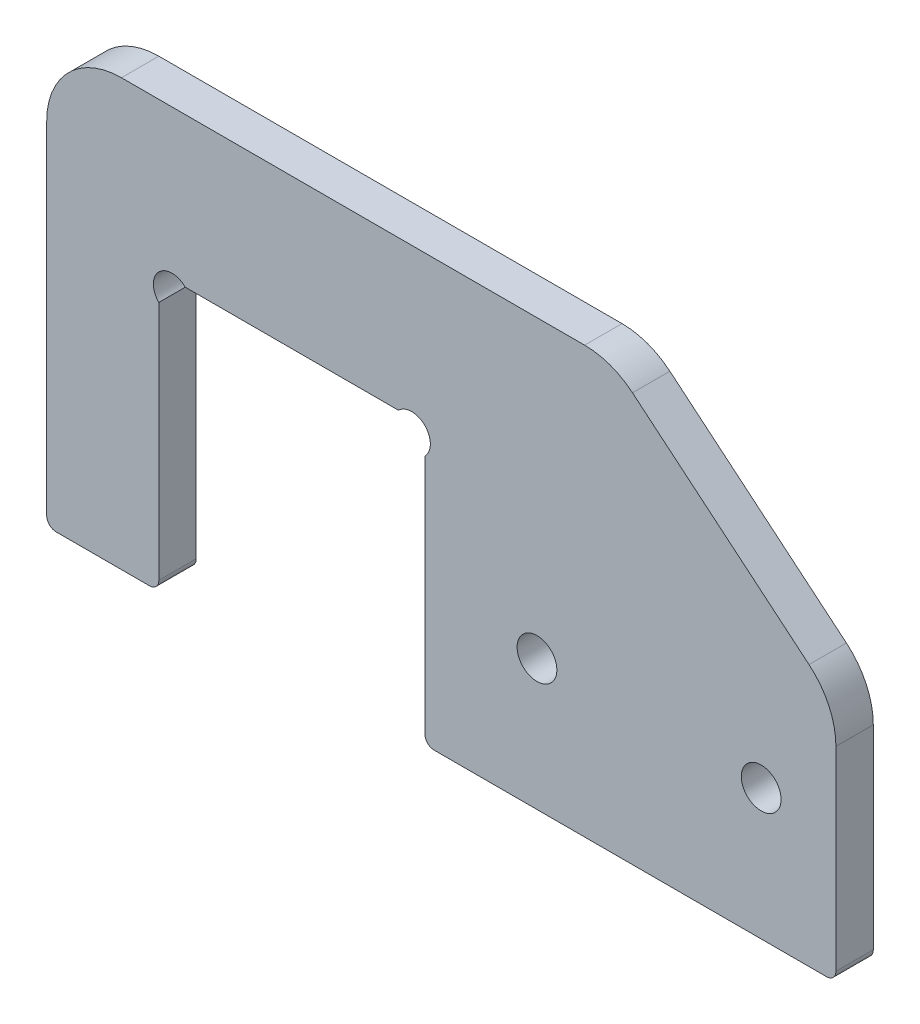
ISO-10303-21;
HEADER;
FILE_DESCRIPTION(('STEP AP214'),'2;1');
FILE_NAME('part.step','',(''),(''),'','','');
FILE_SCHEMA(('AUTOMOTIVE_DESIGN { 1 0 10303 214 1 1 1 1 }'));
ENDSEC;
DATA;
#1=APPLICATION_CONTEXT('core data for automotive mechanical design processes');
#2=APPLICATION_PROTOCOL_DEFINITION('international standard','automotive_design',2000,#1);
#3=PRODUCT_CONTEXT('',#1,'mechanical');
#4=PRODUCT('Part','Part','',(#3));
#5=PRODUCT_RELATED_PRODUCT_CATEGORY('part','',(#4));
#6=PRODUCT_DEFINITION_FORMATION('','',#4);
#7=PRODUCT_DEFINITION_CONTEXT('part definition',#1,'design');
#8=PRODUCT_DEFINITION('design','',#6,#7);
#9=PRODUCT_DEFINITION_SHAPE('','',#8);
#10=(LENGTH_UNIT() NAMED_UNIT(*) SI_UNIT(.MILLI.,.METRE.));
#11=(NAMED_UNIT(*) PLANE_ANGLE_UNIT() SI_UNIT($,.RADIAN.));
#12=(NAMED_UNIT(*) SI_UNIT($,.STERADIAN.) SOLID_ANGLE_UNIT());
#13=UNCERTAINTY_MEASURE_WITH_UNIT(LENGTH_MEASURE(1.E-05),#10,'distance_accuracy_value','');
#14=(GEOMETRIC_REPRESENTATION_CONTEXT(3) GLOBAL_UNCERTAINTY_ASSIGNED_CONTEXT((#13)) GLOBAL_UNIT_ASSIGNED_CONTEXT((#10,
#11,#12)) REPRESENTATION_CONTEXT('',''));
#15=CARTESIAN_POINT('',(0.,0.,0.));
#16=DIRECTION('',(0.,0.,1.));
#17=DIRECTION('',(1.,0.,0.));
#18=AXIS2_PLACEMENT_3D('',#15,#16,#17);
#19=CARTESIAN_POINT('',(-69.85,0.,6.35));
#20=DIRECTION('',(0.,1.,0.));
#21=DIRECTION('',(0.,0.,1.));
#22=AXIS2_PLACEMENT_3D('',#19,#20,#21);
#23=PLANE('',#22);
#24=DIRECTION('',(1.,0.,0.));
#25=VECTOR('',#24,1.);
#26=CARTESIAN_POINT('',(-69.85,0.,0.));
#27=LINE('',#26,#25);
#28=CARTESIAN_POINT('',(-68.2625,0.,0.));
#29=VERTEX_POINT('',#28);
#30=CARTESIAN_POINT('',(-1.58750000000001,0.,0.));
#31=VERTEX_POINT('',#30);
#32=EDGE_CURVE('E298',#29,#31,#27,.T.);
#33=ORIENTED_EDGE('',*,*,#32,.T.);
#34=DIRECTION('',(0.,0.,-1.));
#35=VECTOR('',#34,1.);
#36=CARTESIAN_POINT('',(-1.58750000000001,0.,6.35));
#37=LINE('',#36,#35);
#38=CARTESIAN_POINT('',(-1.58750000000001,0.,6.35));
#39=VERTEX_POINT('',#38);
#40=EDGE_CURVE('E207',#31,#39,#37,.F.);
#41=ORIENTED_EDGE('',*,*,#40,.T.);
#42=DIRECTION('',(1.,0.,0.));
#43=VECTOR('',#42,1.);
#44=CARTESIAN_POINT('',(-69.85,0.,6.35));
#45=LINE('',#44,#43);
#46=CARTESIAN_POINT('',(-68.2625,0.,6.35));
#47=VERTEX_POINT('',#46);
#48=EDGE_CURVE('E183',#47,#39,#45,.T.);
#49=ORIENTED_EDGE('',*,*,#48,.F.);
#50=DIRECTION('',(0.,0.,-1.));
#51=VECTOR('',#50,1.);
#52=CARTESIAN_POINT('',(-68.2625,0.,6.35));
#53=LINE('',#52,#51);
#54=EDGE_CURVE('E204',#47,#29,#53,.T.);
#55=ORIENTED_EDGE('',*,*,#54,.T.);
#56=EDGE_LOOP('',(#33,#41,#49,#55));
#57=FACE_BOUND('',#56,.T.);
#58=ADVANCED_FACE('F35',(#57),#23,.F.);
#59=CARTESIAN_POINT('',(0.,0.,6.35));
#60=DIRECTION('',(-1.,0.,0.));
#61=DIRECTION('',(0.,0.,1.));
#62=AXIS2_PLACEMENT_3D('',#59,#60,#61);
#63=PLANE('',#62);
#64=DIRECTION('',(0.,1.,0.));
#65=VECTOR('',#64,1.);
#66=CARTESIAN_POINT('',(0.,0.,0.));
#67=LINE('',#66,#65);
#68=CARTESIAN_POINT('',(0.,1.5875,0.));
#69=VERTEX_POINT('',#68);
#70=CARTESIAN_POINT('',(0.,34.6916381859976,0.));
#71=VERTEX_POINT('',#70);
#72=EDGE_CURVE('E276',#69,#71,#67,.T.);
#73=ORIENTED_EDGE('',*,*,#72,.T.);
#74=DIRECTION('',(0.,0.,1.));
#75=VECTOR('',#74,1.);
#76=CARTESIAN_POINT('',(0.,34.6916381859976,6.35));
#77=LINE('',#76,#75);
#78=CARTESIAN_POINT('',(0.,34.6916381859976,6.35));
#79=VERTEX_POINT('',#78);
#80=EDGE_CURVE('E248',#71,#79,#77,.T.);
#81=ORIENTED_EDGE('',*,*,#80,.T.);
#82=DIRECTION('',(0.,1.,0.));
#83=VECTOR('',#82,1.);
#84=CARTESIAN_POINT('',(0.,0.,6.35));
#85=LINE('',#84,#83);
#86=CARTESIAN_POINT('',(0.,1.5875,6.35));
#87=VERTEX_POINT('',#86);
#88=EDGE_CURVE('E187',#87,#79,#85,.T.);
#89=ORIENTED_EDGE('',*,*,#88,.F.);
#90=DIRECTION('',(0.,0.,-1.));
#91=VECTOR('',#90,1.);
#92=CARTESIAN_POINT('',(0.,1.5875,6.35));
#93=LINE('',#92,#91);
#94=EDGE_CURVE('E193',#87,#69,#93,.T.);
#95=ORIENTED_EDGE('',*,*,#94,.T.);
#96=EDGE_LOOP('',(#73,#81,#89,#95));
#97=FACE_BOUND('',#96,.T.);
#98=ADVANCED_FACE('F274',(#97),#63,.F.);
#99=CARTESIAN_POINT('',(0.,72.39,6.35));
#100=DIRECTION('',(0.,-1.,0.));
#101=DIRECTION('',(1.,0.,0.));
#102=AXIS2_PLACEMENT_3D('',#99,#100,#101);
#103=PLANE('',#102);
#104=DIRECTION('',(-1.,0.,0.));
#105=VECTOR('',#104,1.);
#106=CARTESIAN_POINT('',(0.,72.39,0.));
#107=LINE('',#106,#105);
#108=CARTESIAN_POINT('',(-42.6980341768029,72.39,0.));
#109=VERTEX_POINT('',#108);
#110=CARTESIAN_POINT('',(-121.412,72.39,0.));
#111=VERTEX_POINT('',#110);
#112=EDGE_CURVE('E303',#109,#111,#107,.T.);
#113=ORIENTED_EDGE('',*,*,#112,.T.);
#114=DIRECTION('',(0.,0.,-1.));
#115=VECTOR('',#114,1.);
#116=CARTESIAN_POINT('',(-121.412,72.39,6.35));
#117=LINE('',#116,#115);
#118=CARTESIAN_POINT('',(-121.412,72.39,6.35));
#119=VERTEX_POINT('',#118);
#120=EDGE_CURVE('E241',#111,#119,#117,.F.);
#121=ORIENTED_EDGE('',*,*,#120,.T.);
#122=DIRECTION('',(-1.,0.,0.));
#123=VECTOR('',#122,1.);
#124=CARTESIAN_POINT('',(0.,72.39,6.35));
#125=LINE('',#124,#123);
#126=CARTESIAN_POINT('',(-42.6980341768029,72.39,6.35));
#127=VERTEX_POINT('',#126);
#128=EDGE_CURVE('E280',#127,#119,#125,.T.);
#129=ORIENTED_EDGE('',*,*,#128,.F.);
#130=DIRECTION('',(0.,0.,1.));
#131=VECTOR('',#130,1.);
#132=CARTESIAN_POINT('',(-42.6980341768029,72.39,6.35));
#133=LINE('',#132,#131);
#134=EDGE_CURVE('E239',#127,#109,#133,.F.);
#135=ORIENTED_EDGE('',*,*,#134,.T.);
#136=EDGE_LOOP('',(#113,#121,#129,#135));
#137=FACE_BOUND('',#136,.T.);
#138=ADVANCED_FACE('F362',(#137),#103,.F.);
#139=CARTESIAN_POINT('',(-134.112,72.39,6.35));
#140=DIRECTION('',(1.,0.,0.));
#141=DIRECTION('',(0.,0.,-1.));
#142=AXIS2_PLACEMENT_3D('',#139,#140,#141);
#143=PLANE('',#142);
#144=DIRECTION('',(0.,-1.,0.));
#145=VECTOR('',#144,1.);
#146=CARTESIAN_POINT('',(-134.112,72.39,6.35));
#147=LINE('',#146,#145);
#148=CARTESIAN_POINT('',(-134.112,59.69,6.35));
#149=VERTEX_POINT('',#148);
#150=CARTESIAN_POINT('',(-134.112,1.58750000000001,6.35));
#151=VERTEX_POINT('',#150);
#152=EDGE_CURVE('E283',#149,#151,#147,.T.);
#153=ORIENTED_EDGE('',*,*,#152,.F.);
#154=DIRECTION('',(0.,0.,-1.));
#155=VECTOR('',#154,1.);
#156=CARTESIAN_POINT('',(-134.112,59.69,6.35));
#157=LINE('',#156,#155);
#158=CARTESIAN_POINT('',(-134.112,59.69,0.));
#159=VERTEX_POINT('',#158);
#160=EDGE_CURVE('E230',#149,#159,#157,.T.);
#161=ORIENTED_EDGE('',*,*,#160,.T.);
#162=DIRECTION('',(0.,-1.,0.));
#163=VECTOR('',#162,1.);
#164=CARTESIAN_POINT('',(-134.112,72.39,0.));
#165=LINE('',#164,#163);
#166=CARTESIAN_POINT('',(-134.112,1.58750000000001,0.));
#167=VERTEX_POINT('',#166);
#168=EDGE_CURVE('E306',#159,#167,#165,.T.);
#169=ORIENTED_EDGE('',*,*,#168,.T.);
#170=DIRECTION('',(0.,0.,-1.));
#171=VECTOR('',#170,1.);
#172=CARTESIAN_POINT('',(-134.112,1.58750000000001,6.35));
#173=LINE('',#172,#171);
#174=EDGE_CURVE('E222',#167,#151,#173,.F.);
#175=ORIENTED_EDGE('',*,*,#174,.T.);
#176=EDGE_LOOP('',(#153,#161,#169,#175));
#177=FACE_BOUND('',#176,.T.);
#178=ADVANCED_FACE('F402',(#177),#143,.F.);
#179=CARTESIAN_POINT('',(-134.112,0.,6.35));
#180=DIRECTION('',(0.,1.,0.));
#181=DIRECTION('',(0.,0.,1.));
#182=AXIS2_PLACEMENT_3D('',#179,#180,#181);
#183=PLANE('',#182);
#184=DIRECTION('',(1.,0.,0.));
#185=VECTOR('',#184,1.);
#186=CARTESIAN_POINT('',(-134.112,0.,6.35));
#187=LINE('',#186,#185);
#188=CARTESIAN_POINT('',(-132.5245,0.,6.35));
#189=VERTEX_POINT('',#188);
#190=CARTESIAN_POINT('',(-116.6495,0.,6.35));
#191=VERTEX_POINT('',#190);
#192=EDGE_CURVE('E288',#189,#191,#187,.T.);
#193=ORIENTED_EDGE('',*,*,#192,.F.);
#194=DIRECTION('',(0.,0.,-1.));
#195=VECTOR('',#194,1.);
#196=CARTESIAN_POINT('',(-132.5245,0.,6.35));
#197=LINE('',#196,#195);
#198=CARTESIAN_POINT('',(-132.5245,0.,0.));
#199=VERTEX_POINT('',#198);
#200=EDGE_CURVE('E219',#189,#199,#197,.T.);
#201=ORIENTED_EDGE('',*,*,#200,.T.);
#202=DIRECTION('',(1.,0.,0.));
#203=VECTOR('',#202,1.);
#204=CARTESIAN_POINT('',(-134.112,0.,0.));
#205=LINE('',#204,#203);
#206=CARTESIAN_POINT('',(-116.6495,0.,0.));
#207=VERTEX_POINT('',#206);
#208=EDGE_CURVE('E308',#199,#207,#205,.T.);
#209=ORIENTED_EDGE('',*,*,#208,.T.);
#210=DIRECTION('',(0.,0.,-1.));
#211=VECTOR('',#210,1.);
#212=CARTESIAN_POINT('',(-116.6495,0.,6.35));
#213=LINE('',#212,#211);
#214=EDGE_CURVE('E217',#207,#191,#213,.F.);
#215=ORIENTED_EDGE('',*,*,#214,.T.);
#216=EDGE_LOOP('',(#193,#201,#209,#215));
#217=FACE_BOUND('',#216,.T.);
#218=ADVANCED_FACE('F410',(#217),#183,.F.);
#219=CARTESIAN_POINT('',(-115.062,0.,6.35));
#220=DIRECTION('',(-1.,0.,0.));
#221=DIRECTION('',(0.,0.,1.));
#222=AXIS2_PLACEMENT_3D('',#219,#220,#221);
#223=PLANE('',#222);
#224=DIRECTION('',(0.,1.,0.));
#225=VECTOR('',#224,1.);
#226=CARTESIAN_POINT('',(-115.062,0.,0.));
#227=LINE('',#226,#225);
#228=CARTESIAN_POINT('',(-115.062,1.5875,0.));
#229=VERTEX_POINT('',#228);
#230=CARTESIAN_POINT('',(-115.062,42.4998719394655,0.));
#231=VERTEX_POINT('',#230);
#232=EDGE_CURVE('E189',#229,#231,#227,.T.);
#233=ORIENTED_EDGE('',*,*,#232,.T.);
#234=DIRECTION('',(0.,0.,1.));
#235=VECTOR('',#234,1.);
#236=CARTESIAN_POINT('',(-115.062,42.4998719394655,0.));
#237=LINE('',#236,#235);
#238=CARTESIAN_POINT('',(-115.062,42.4998719394655,6.35));
#239=VERTEX_POINT('',#238);
#240=EDGE_CURVE('E50',#231,#239,#237,.T.);
#241=ORIENTED_EDGE('',*,*,#240,.T.);
#242=DIRECTION('',(0.,1.,0.));
#243=VECTOR('',#242,1.);
#244=CARTESIAN_POINT('',(-115.062,0.,6.35));
#245=LINE('',#244,#243);
#246=CARTESIAN_POINT('',(-115.062,1.5875,6.35));
#247=VERTEX_POINT('',#246);
#248=EDGE_CURVE('E291',#247,#239,#245,.T.);
#249=ORIENTED_EDGE('',*,*,#248,.F.);
#250=DIRECTION('',(0.,0.,-1.));
#251=VECTOR('',#250,1.);
#252=CARTESIAN_POINT('',(-115.062,1.5875,6.35));
#253=LINE('',#252,#251);
#254=EDGE_CURVE('E225',#247,#229,#253,.T.);
#255=ORIENTED_EDGE('',*,*,#254,.T.);
#256=EDGE_LOOP('',(#233,#241,#249,#255));
#257=FACE_BOUND('',#256,.T.);
#258=ADVANCED_FACE('F313',(#257),#223,.F.);
#259=CARTESIAN_POINT('',(-115.062,46.99,6.35));
#260=DIRECTION('',(0.,1.,0.));
#261=DIRECTION('',(0.,0.,1.));
#262=AXIS2_PLACEMENT_3D('',#259,#260,#261);
#263=PLANE('',#262);
#264=DIRECTION('',(1.,0.,0.));
#265=VECTOR('',#264,1.);
#266=CARTESIAN_POINT('',(-115.062,46.99,6.35));
#267=LINE('',#266,#265);
#268=CARTESIAN_POINT('',(-110.571871939465,46.99,6.35));
#269=VERTEX_POINT('',#268);
#270=CARTESIAN_POINT('',(-74.3401280605347,46.99,6.35));
#271=VERTEX_POINT('',#270);
#272=EDGE_CURVE('E294',#269,#271,#267,.T.);
#273=ORIENTED_EDGE('',*,*,#272,.F.);
#274=DIRECTION('',(0.,0.,1.));
#275=VECTOR('',#274,1.);
#276=CARTESIAN_POINT('',(-110.571871939465,46.99,0.));
#277=LINE('',#276,#275);
#278=CARTESIAN_POINT('',(-110.571871939465,46.99,0.));
#279=VERTEX_POINT('',#278);
#280=EDGE_CURVE('E320',#269,#279,#277,.F.);
#281=ORIENTED_EDGE('',*,*,#280,.T.);
#282=DIRECTION('',(1.,0.,0.));
#283=VECTOR('',#282,1.);
#284=CARTESIAN_POINT('',(-115.062,46.99,0.));
#285=LINE('',#284,#283);
#286=CARTESIAN_POINT('',(-74.3401280605347,46.99,0.));
#287=VERTEX_POINT('',#286);
#288=EDGE_CURVE('E184',#279,#287,#285,.T.);
#289=ORIENTED_EDGE('',*,*,#288,.T.);
#290=DIRECTION('',(0.,0.,1.));
#291=VECTOR('',#290,1.);
#292=CARTESIAN_POINT('',(-74.3401280605347,46.99,0.));
#293=LINE('',#292,#291);
#294=EDGE_CURVE('E165',#287,#271,#293,.T.);
#295=ORIENTED_EDGE('',*,*,#294,.T.);
#296=EDGE_LOOP('',(#273,#281,#289,#295));
#297=FACE_BOUND('',#296,.T.);
#298=ADVANCED_FACE('F323',(#297),#263,.F.);
#299=CARTESIAN_POINT('',(-69.85,46.99,6.35));
#300=DIRECTION('',(1.,0.,0.));
#301=DIRECTION('',(0.,1.,0.));
#302=AXIS2_PLACEMENT_3D('',#299,#300,#301);
#303=PLANE('',#302);
#304=DIRECTION('',(0.,-1.,0.));
#305=VECTOR('',#304,1.);
#306=CARTESIAN_POINT('',(-69.85,46.99,6.35));
#307=LINE('',#306,#305);
#308=CARTESIAN_POINT('',(-69.85,42.4998719394655,6.35));
#309=VERTEX_POINT('',#308);
#310=CARTESIAN_POINT('',(-69.85,1.58750000000001,6.35));
#311=VERTEX_POINT('',#310);
#312=EDGE_CURVE('E176',#309,#311,#307,.T.);
#313=ORIENTED_EDGE('',*,*,#312,.F.);
#314=DIRECTION('',(0.,0.,1.));
#315=VECTOR('',#314,1.);
#316=CARTESIAN_POINT('',(-69.85,42.4998719394655,0.));
#317=LINE('',#316,#315);
#318=CARTESIAN_POINT('',(-69.85,42.4998719394655,0.));
#319=VERTEX_POINT('',#318);
#320=EDGE_CURVE('E162',#309,#319,#317,.F.);
#321=ORIENTED_EDGE('',*,*,#320,.T.);
#322=DIRECTION('',(0.,-1.,0.));
#323=VECTOR('',#322,1.);
#324=CARTESIAN_POINT('',(-69.85,46.99,0.));
#325=LINE('',#324,#323);
#326=CARTESIAN_POINT('',(-69.85,1.58750000000001,0.));
#327=VERTEX_POINT('',#326);
#328=EDGE_CURVE('E174',#319,#327,#325,.T.);
#329=ORIENTED_EDGE('',*,*,#328,.T.);
#330=DIRECTION('',(0.,0.,-1.));
#331=VECTOR('',#330,1.);
#332=CARTESIAN_POINT('',(-69.85,1.5875,6.35));
#333=LINE('',#332,#331);
#334=EDGE_CURVE('E228',#327,#311,#333,.F.);
#335=ORIENTED_EDGE('',*,*,#334,.T.);
#336=EDGE_LOOP('',(#313,#321,#329,#335));
#337=FACE_BOUND('',#336,.T.);
#338=ADVANCED_FACE('F172',(#337),#303,.F.);
#339=CARTESIAN_POINT('',(0.,0.,6.35));
#340=DIRECTION('',(0.,0.,1.));
#341=DIRECTION('',(1.,0.,0.));
#342=AXIS2_PLACEMENT_3D('',#339,#340,#341);
#343=PLANE('',#342);
#344=CARTESIAN_POINT('',(-112.816935969733,44.7449359697327,6.35));
#345=DIRECTION('',(0.,0.,1.));
#346=DIRECTION('',(1.,0.,0.));
#347=AXIS2_PLACEMENT_3D('',#344,#345,#346);
#348=CIRCLE('',#347,3.17499999999999);
#349=EDGE_CURVE('E177',#269,#239,#348,.T.);
#350=ORIENTED_EDGE('',*,*,#349,.F.);
#351=ORIENTED_EDGE('',*,*,#272,.T.);
#352=CARTESIAN_POINT('',(-72.0950640302674,44.7449359697327,6.35));
#353=DIRECTION('',(0.,0.,1.));
#354=DIRECTION('',(-1.,0.,0.));
#355=AXIS2_PLACEMENT_3D('',#352,#353,#354);
#356=CIRCLE('',#355,3.17499999999998);
#357=EDGE_CURVE('E412',#309,#271,#356,.T.);
#358=ORIENTED_EDGE('',*,*,#357,.F.);
#359=ORIENTED_EDGE('',*,*,#312,.T.);
#360=CARTESIAN_POINT('',(-68.2625,1.5875,6.35));
#361=DIRECTION('',(0.,0.,1.));
#362=DIRECTION('',(1.,0.,0.));
#363=AXIS2_PLACEMENT_3D('',#360,#361,#362);
#364=CIRCLE('',#363,1.5875);
#365=EDGE_CURVE('E209',#311,#47,#364,.T.);
#366=ORIENTED_EDGE('',*,*,#365,.T.);
#367=ORIENTED_EDGE('',*,*,#48,.T.);
#368=CARTESIAN_POINT('',(-1.5875,1.5875,6.35));
#369=DIRECTION('',(0.,0.,1.));
#370=DIRECTION('',(1.,0.,0.));
#371=AXIS2_PLACEMENT_3D('',#368,#369,#370);
#372=CIRCLE('',#371,1.5875);
#373=EDGE_CURVE('E215',#39,#87,#372,.T.);
#374=ORIENTED_EDGE('',*,*,#373,.T.);
#375=ORIENTED_EDGE('',*,*,#88,.T.);
#376=CARTESIAN_POINT('',(-12.7,34.6916381859976,6.35));
#377=DIRECTION('',(0.,0.,1.));
#378=DIRECTION('',(1.,0.,0.));
#379=AXIS2_PLACEMENT_3D('',#376,#377,#378);
#380=CIRCLE('',#379,12.7);
#381=CARTESIAN_POINT('',(-4.56965812426111,44.4480484368842,6.35));
#382=VERTEX_POINT('',#381);
#383=EDGE_CURVE('E57',#79,#382,#380,.T.);
#384=ORIENTED_EDGE('',*,*,#383,.T.);
#385=DIRECTION('',(0.768221279597376,-0.64018439966448,0.));
#386=VECTOR('',#385,1.);
#387=CARTESIAN_POINT('',(0.,40.64,6.35));
#388=LINE('',#387,#386);
#389=CARTESIAN_POINT('',(-34.567692301064,69.4464102508866,6.35));
#390=VERTEX_POINT('',#389);
#391=EDGE_CURVE('E261',#390,#382,#388,.T.);
#392=ORIENTED_EDGE('',*,*,#391,.F.);
#393=CARTESIAN_POINT('',(-42.6980341768029,59.69,6.35));
#394=DIRECTION('',(0.,0.,1.));
#395=DIRECTION('',(1.,0.,0.));
#396=AXIS2_PLACEMENT_3D('',#393,#394,#395);
#397=CIRCLE('',#396,12.7);
#398=EDGE_CURVE('E243',#390,#127,#397,.T.);
#399=ORIENTED_EDGE('',*,*,#398,.T.);
#400=ORIENTED_EDGE('',*,*,#128,.T.);
#401=CARTESIAN_POINT('',(-121.412,59.69,6.35));
#402=DIRECTION('',(0.,0.,1.));
#403=DIRECTION('',(1.,0.,0.));
#404=AXIS2_PLACEMENT_3D('',#401,#402,#403);
#405=CIRCLE('',#404,12.7);
#406=EDGE_CURVE('E246',#119,#149,#405,.T.);
#407=ORIENTED_EDGE('',*,*,#406,.T.);
#408=ORIENTED_EDGE('',*,*,#152,.T.);
#409=CARTESIAN_POINT('',(-132.5245,1.5875,6.35));
#410=DIRECTION('',(0.,0.,1.));
#411=DIRECTION('',(1.,0.,0.));
#412=AXIS2_PLACEMENT_3D('',#409,#410,#411);
#413=CIRCLE('',#412,1.5875);
#414=EDGE_CURVE('E213',#151,#189,#413,.T.);
#415=ORIENTED_EDGE('',*,*,#414,.T.);
#416=ORIENTED_EDGE('',*,*,#192,.T.);
#417=CARTESIAN_POINT('',(-116.6495,1.5875,6.35));
#418=DIRECTION('',(0.,0.,1.));
#419=DIRECTION('',(1.,0.,0.));
#420=AXIS2_PLACEMENT_3D('',#417,#418,#419);
#421=CIRCLE('',#420,1.5875);
#422=EDGE_CURVE('E211',#191,#247,#421,.T.);
#423=ORIENTED_EDGE('',*,*,#422,.T.);
#424=ORIENTED_EDGE('',*,*,#248,.T.);
#425=EDGE_LOOP('',(#350,#351,#358,#359,#366,#367,#374,#375,#384,#392,#399,#400,#407,#408,#415,
#416,#423,#424));
#426=FACE_BOUND('',#425,.T.);
#427=CARTESIAN_POINT('',(-50.8,22.225,6.35));
#428=DIRECTION('',(0.,0.,1.));
#429=DIRECTION('',(1.,0.,0.));
#430=AXIS2_PLACEMENT_3D('',#427,#428,#429);
#431=CIRCLE('',#430,3.3782);
#432=CARTESIAN_POINT('',(-47.4218,22.225,6.35));
#433=VERTEX_POINT('',#432);
#434=EDGE_CURVE('E268',#433,#433,#431,.T.);
#435=ORIENTED_EDGE('',*,*,#434,.F.);
#436=EDGE_LOOP('',(#435));
#437=FACE_BOUND('',#436,.T.);
#438=CARTESIAN_POINT('',(-12.7,22.225,6.35));
#439=DIRECTION('',(0.,0.,1.));
#440=DIRECTION('',(1.,0.,0.));
#441=AXIS2_PLACEMENT_3D('',#438,#439,#440);
#442=CIRCLE('',#441,3.3782);
#443=CARTESIAN_POINT('',(-9.3218,22.225,6.35));
#444=VERTEX_POINT('',#443);
#445=EDGE_CURVE('E334',#444,#444,#442,.T.);
#446=ORIENTED_EDGE('',*,*,#445,.F.);
#447=EDGE_LOOP('',(#446));
#448=FACE_BOUND('',#447,.T.);
#449=ADVANCED_FACE('F277',(#426,#437,#448),#343,.T.);
#450=CARTESIAN_POINT('',(0.,0.,0.));
#451=DIRECTION('',(0.,0.,1.));
#452=DIRECTION('',(1.,0.,0.));
#453=AXIS2_PLACEMENT_3D('',#450,#451,#452);
#454=PLANE('',#453);
#455=CARTESIAN_POINT('',(-50.8,22.225,0.));
#456=DIRECTION('',(0.,0.,1.));
#457=DIRECTION('',(1.,0.,0.));
#458=AXIS2_PLACEMENT_3D('',#455,#456,#457);
#459=CIRCLE('',#458,3.3782);
#460=CARTESIAN_POINT('',(-47.4218,22.225,0.));
#461=VERTEX_POINT('',#460);
#462=EDGE_CURVE('E331',#461,#461,#459,.T.);
#463=ORIENTED_EDGE('',*,*,#462,.T.);
#464=EDGE_LOOP('',(#463));
#465=FACE_BOUND('',#464,.T.);
#466=CARTESIAN_POINT('',(-12.7,22.225,0.));
#467=DIRECTION('',(0.,0.,1.));
#468=DIRECTION('',(1.,0.,0.));
#469=AXIS2_PLACEMENT_3D('',#466,#467,#468);
#470=CIRCLE('',#469,3.3782);
#471=CARTESIAN_POINT('',(-9.3218,22.225,0.));
#472=VERTEX_POINT('',#471);
#473=EDGE_CURVE('E301',#472,#472,#470,.T.);
#474=ORIENTED_EDGE('',*,*,#473,.T.);
#475=EDGE_LOOP('',(#474));
#476=FACE_BOUND('',#475,.T.);
#477=ORIENTED_EDGE('',*,*,#288,.F.);
#478=CARTESIAN_POINT('',(-112.816935969733,44.7449359697327,0.));
#479=DIRECTION('',(0.,0.,1.));
#480=DIRECTION('',(1.,0.,0.));
#481=AXIS2_PLACEMENT_3D('',#478,#479,#480);
#482=CIRCLE('',#481,3.17499999999999);
#483=EDGE_CURVE('E11',#279,#231,#482,.T.);
#484=ORIENTED_EDGE('',*,*,#483,.T.);
#485=ORIENTED_EDGE('',*,*,#232,.F.);
#486=CARTESIAN_POINT('',(-116.6495,1.5875,0.));
#487=DIRECTION('',(0.,0.,1.));
#488=DIRECTION('',(1.,0.,0.));
#489=AXIS2_PLACEMENT_3D('',#486,#487,#488);
#490=CIRCLE('',#489,1.5875);
#491=EDGE_CURVE('E197',#229,#207,#490,.F.);
#492=ORIENTED_EDGE('',*,*,#491,.T.);
#493=ORIENTED_EDGE('',*,*,#208,.F.);
#494=CARTESIAN_POINT('',(-132.5245,1.5875,0.));
#495=DIRECTION('',(0.,0.,1.));
#496=DIRECTION('',(1.,0.,0.));
#497=AXIS2_PLACEMENT_3D('',#494,#495,#496);
#498=CIRCLE('',#497,1.5875);
#499=EDGE_CURVE('E199',#199,#167,#498,.F.);
#500=ORIENTED_EDGE('',*,*,#499,.T.);
#501=ORIENTED_EDGE('',*,*,#168,.F.);
#502=CARTESIAN_POINT('',(-121.412,59.69,0.));
#503=DIRECTION('',(0.,0.,1.));
#504=DIRECTION('',(1.,0.,0.));
#505=AXIS2_PLACEMENT_3D('',#502,#503,#504);
#506=CIRCLE('',#505,12.7);
#507=EDGE_CURVE('E237',#159,#111,#506,.F.);
#508=ORIENTED_EDGE('',*,*,#507,.T.);
#509=ORIENTED_EDGE('',*,*,#112,.F.);
#510=CARTESIAN_POINT('',(-42.6980341768029,59.69,0.));
#511=DIRECTION('',(0.,0.,1.));
#512=DIRECTION('',(1.,0.,0.));
#513=AXIS2_PLACEMENT_3D('',#510,#511,#512);
#514=CIRCLE('',#513,12.7);
#515=CARTESIAN_POINT('',(-34.567692301064,69.4464102508866,0.));
#516=VERTEX_POINT('',#515);
#517=EDGE_CURVE('E233',#109,#516,#514,.F.);
#518=ORIENTED_EDGE('',*,*,#517,.T.);
#519=DIRECTION('',(0.768221279597376,-0.64018439966448,0.));
#520=VECTOR('',#519,1.);
#521=CARTESIAN_POINT('',(0.,40.64,0.));
#522=LINE('',#521,#520);
#523=CARTESIAN_POINT('',(-4.56965812426111,44.4480484368842,0.));
#524=VERTEX_POINT('',#523);
#525=EDGE_CURVE('E259',#516,#524,#522,.T.);
#526=ORIENTED_EDGE('',*,*,#525,.T.);
#527=CARTESIAN_POINT('',(-12.7,34.6916381859976,0.));
#528=DIRECTION('',(0.,0.,1.));
#529=DIRECTION('',(1.,0.,0.));
#530=AXIS2_PLACEMENT_3D('',#527,#528,#529);
#531=CIRCLE('',#530,12.7);
#532=EDGE_CURVE('E235',#524,#71,#531,.F.);
#533=ORIENTED_EDGE('',*,*,#532,.T.);
#534=ORIENTED_EDGE('',*,*,#72,.F.);
#535=CARTESIAN_POINT('',(-1.5875,1.5875,0.));
#536=DIRECTION('',(0.,0.,1.));
#537=DIRECTION('',(1.,0.,0.));
#538=AXIS2_PLACEMENT_3D('',#535,#536,#537);
#539=CIRCLE('',#538,1.5875);
#540=EDGE_CURVE('E202',#69,#31,#539,.F.);
#541=ORIENTED_EDGE('',*,*,#540,.T.);
#542=ORIENTED_EDGE('',*,*,#32,.F.);
#543=CARTESIAN_POINT('',(-68.2625,1.5875,0.));
#544=DIRECTION('',(0.,0.,1.));
#545=DIRECTION('',(1.,0.,0.));
#546=AXIS2_PLACEMENT_3D('',#543,#544,#545);
#547=CIRCLE('',#546,1.5875);
#548=EDGE_CURVE('E181',#29,#327,#547,.F.);
#549=ORIENTED_EDGE('',*,*,#548,.T.);
#550=ORIENTED_EDGE('',*,*,#328,.F.);
#551=CARTESIAN_POINT('',(-72.0950640302674,44.7449359697327,0.));
#552=DIRECTION('',(0.,0.,1.));
#553=DIRECTION('',(1.,0.,0.));
#554=AXIS2_PLACEMENT_3D('',#551,#552,#553);
#555=CIRCLE('',#554,3.17499999999998);
#556=EDGE_CURVE('E43',#319,#287,#555,.T.);
#557=ORIENTED_EDGE('',*,*,#556,.T.);
#558=EDGE_LOOP('',(#477,#484,#485,#492,#493,#500,#501,#508,#509,#518,#526,#533,#534,#541,#542,
#549,#550,#557));
#559=FACE_BOUND('',#558,.T.);
#560=ADVANCED_FACE('F179',(#465,#476,#559),#454,.F.);
#561=CARTESIAN_POINT('',(-12.7,22.225,6.35));
#562=DIRECTION('',(0.,0.,1.));
#563=DIRECTION('',(1.,0.,0.));
#564=AXIS2_PLACEMENT_3D('',#561,#562,#563);
#565=CYLINDRICAL_SURFACE('',#564,3.3782);
#566=ORIENTED_EDGE('',*,*,#473,.F.);
#567=EDGE_LOOP('',(#566));
#568=FACE_BOUND('',#567,.T.);
#569=ORIENTED_EDGE('',*,*,#445,.T.);
#570=EDGE_LOOP('',(#569));
#571=FACE_BOUND('',#570,.T.);
#572=ADVANCED_FACE('F340',(#568,#571),#565,.F.);
#573=CARTESIAN_POINT('',(-50.8,22.225,6.35));
#574=DIRECTION('',(0.,0.,1.));
#575=DIRECTION('',(1.,0.,0.));
#576=AXIS2_PLACEMENT_3D('',#573,#574,#575);
#577=CYLINDRICAL_SURFACE('',#576,3.3782);
#578=ORIENTED_EDGE('',*,*,#462,.F.);
#579=EDGE_LOOP('',(#578));
#580=FACE_BOUND('',#579,.T.);
#581=ORIENTED_EDGE('',*,*,#434,.T.);
#582=EDGE_LOOP('',(#581));
#583=FACE_BOUND('',#582,.T.);
#584=ADVANCED_FACE('F343',(#580,#583),#577,.F.);
#585=CARTESIAN_POINT('',(0.,40.64,0.));
#586=DIRECTION('',(-0.64018439966448,-0.768221279597376,0.));
#587=DIRECTION('',(0.768221279597376,-0.64018439966448,0.));
#588=AXIS2_PLACEMENT_3D('',#585,#586,#587);
#589=PLANE('',#588);
#590=ORIENTED_EDGE('',*,*,#391,.T.);
#591=DIRECTION('',(0.,0.,1.));
#592=VECTOR('',#591,1.);
#593=CARTESIAN_POINT('',(-4.56965812426111,44.4480484368842,0.));
#594=LINE('',#593,#592);
#595=EDGE_CURVE('E170',#382,#524,#594,.F.);
#596=ORIENTED_EDGE('',*,*,#595,.T.);
#597=ORIENTED_EDGE('',*,*,#525,.F.);
#598=DIRECTION('',(0.,0.,1.));
#599=VECTOR('',#598,1.);
#600=CARTESIAN_POINT('',(-34.567692301064,69.4464102508867,0.));
#601=LINE('',#600,#599);
#602=EDGE_CURVE('E251',#516,#390,#601,.T.);
#603=ORIENTED_EDGE('',*,*,#602,.T.);
#604=EDGE_LOOP('',(#590,#596,#597,#603));
#605=FACE_BOUND('',#604,.T.);
#606=ADVANCED_FACE('F258',(#605),#589,.F.);
#607=CARTESIAN_POINT('',(-1.5875,1.5875,6.35));
#608=DIRECTION('',(0.,0.,-1.));
#609=DIRECTION('',(-1.,0.,0.));
#610=AXIS2_PLACEMENT_3D('',#607,#608,#609);
#611=CYLINDRICAL_SURFACE('',#610,1.5875);
#612=ORIENTED_EDGE('',*,*,#373,.F.);
#613=ORIENTED_EDGE('',*,*,#40,.F.);
#614=ORIENTED_EDGE('',*,*,#540,.F.);
#615=ORIENTED_EDGE('',*,*,#94,.F.);
#616=EDGE_LOOP('',(#612,#613,#614,#615));
#617=FACE_BOUND('',#616,.T.);
#618=ADVANCED_FACE('F366',(#617),#611,.T.);
#619=CARTESIAN_POINT('',(-132.5245,1.5875,6.35));
#620=DIRECTION('',(0.,0.,-1.));
#621=DIRECTION('',(-1.,0.,0.));
#622=AXIS2_PLACEMENT_3D('',#619,#620,#621);
#623=CYLINDRICAL_SURFACE('',#622,1.5875);
#624=ORIENTED_EDGE('',*,*,#414,.F.);
#625=ORIENTED_EDGE('',*,*,#174,.F.);
#626=ORIENTED_EDGE('',*,*,#499,.F.);
#627=ORIENTED_EDGE('',*,*,#200,.F.);
#628=EDGE_LOOP('',(#624,#625,#626,#627));
#629=FACE_BOUND('',#628,.T.);
#630=ADVANCED_FACE('F369',(#629),#623,.T.);
#631=CARTESIAN_POINT('',(-116.6495,1.5875,6.35));
#632=DIRECTION('',(0.,0.,-1.));
#633=DIRECTION('',(-1.,0.,0.));
#634=AXIS2_PLACEMENT_3D('',#631,#632,#633);
#635=CYLINDRICAL_SURFACE('',#634,1.5875);
#636=ORIENTED_EDGE('',*,*,#422,.F.);
#637=ORIENTED_EDGE('',*,*,#214,.F.);
#638=ORIENTED_EDGE('',*,*,#491,.F.);
#639=ORIENTED_EDGE('',*,*,#254,.F.);
#640=EDGE_LOOP('',(#636,#637,#638,#639));
#641=FACE_BOUND('',#640,.T.);
#642=ADVANCED_FACE('F373',(#641),#635,.T.);
#643=CARTESIAN_POINT('',(-68.2625,1.5875,6.35));
#644=DIRECTION('',(0.,0.,-1.));
#645=DIRECTION('',(-1.,0.,0.));
#646=AXIS2_PLACEMENT_3D('',#643,#644,#645);
#647=CYLINDRICAL_SURFACE('',#646,1.5875);
#648=ORIENTED_EDGE('',*,*,#365,.F.);
#649=ORIENTED_EDGE('',*,*,#334,.F.);
#650=ORIENTED_EDGE('',*,*,#548,.F.);
#651=ORIENTED_EDGE('',*,*,#54,.F.);
#652=EDGE_LOOP('',(#648,#649,#650,#651));
#653=FACE_BOUND('',#652,.T.);
#654=ADVANCED_FACE('F377',(#653),#647,.T.);
#655=CARTESIAN_POINT('',(-121.412,59.69,6.35));
#656=DIRECTION('',(0.,0.,-1.));
#657=DIRECTION('',(-1.,0.,0.));
#658=AXIS2_PLACEMENT_3D('',#655,#656,#657);
#659=CYLINDRICAL_SURFACE('',#658,12.7);
#660=ORIENTED_EDGE('',*,*,#406,.F.);
#661=ORIENTED_EDGE('',*,*,#120,.F.);
#662=ORIENTED_EDGE('',*,*,#507,.F.);
#663=ORIENTED_EDGE('',*,*,#160,.F.);
#664=EDGE_LOOP('',(#660,#661,#662,#663));
#665=FACE_BOUND('',#664,.T.);
#666=ADVANCED_FACE('F381',(#665),#659,.T.);
#667=CARTESIAN_POINT('',(-12.7,34.6916381859976,6.35));
#668=DIRECTION('',(0.,0.,1.));
#669=DIRECTION('',(1.,0.,0.));
#670=AXIS2_PLACEMENT_3D('',#667,#668,#669);
#671=CYLINDRICAL_SURFACE('',#670,12.7);
#672=ORIENTED_EDGE('',*,*,#532,.F.);
#673=ORIENTED_EDGE('',*,*,#595,.F.);
#674=ORIENTED_EDGE('',*,*,#383,.F.);
#675=ORIENTED_EDGE('',*,*,#80,.F.);
#676=EDGE_LOOP('',(#672,#673,#674,#675));
#677=FACE_BOUND('',#676,.T.);
#678=ADVANCED_FACE('F271',(#677),#671,.T.);
#679=CARTESIAN_POINT('',(-42.6980341768029,59.69,0.));
#680=DIRECTION('',(0.,0.,1.));
#681=DIRECTION('',(1.,0.,0.));
#682=AXIS2_PLACEMENT_3D('',#679,#680,#681);
#683=CYLINDRICAL_SURFACE('',#682,12.7);
#684=ORIENTED_EDGE('',*,*,#517,.F.);
#685=ORIENTED_EDGE('',*,*,#134,.F.);
#686=ORIENTED_EDGE('',*,*,#398,.F.);
#687=ORIENTED_EDGE('',*,*,#602,.F.);
#688=EDGE_LOOP('',(#684,#685,#686,#687));
#689=FACE_BOUND('',#688,.T.);
#690=ADVANCED_FACE('F37',(#689),#683,.T.);
#691=CARTESIAN_POINT('',(-72.0950640302674,44.7449359697327,0.));
#692=DIRECTION('',(0.,0.,1.));
#693=DIRECTION('',(1.,0.,0.));
#694=AXIS2_PLACEMENT_3D('',#691,#692,#693);
#695=CYLINDRICAL_SURFACE('',#694,3.17499999999998);
#696=ORIENTED_EDGE('',*,*,#556,.F.);
#697=ORIENTED_EDGE('',*,*,#320,.F.);
#698=ORIENTED_EDGE('',*,*,#357,.T.);
#699=ORIENTED_EDGE('',*,*,#294,.F.);
#700=EDGE_LOOP('',(#696,#697,#698,#699));
#701=FACE_BOUND('',#700,.T.);
#702=ADVANCED_FACE('F161',(#701),#695,.F.);
#703=CARTESIAN_POINT('',(-112.816935969733,44.7449359697327,0.));
#704=DIRECTION('',(0.,0.,1.));
#705=DIRECTION('',(1.,0.,0.));
#706=AXIS2_PLACEMENT_3D('',#703,#704,#705);
#707=CYLINDRICAL_SURFACE('',#706,3.17499999999999);
#708=ORIENTED_EDGE('',*,*,#483,.F.);
#709=ORIENTED_EDGE('',*,*,#280,.F.);
#710=ORIENTED_EDGE('',*,*,#349,.T.);
#711=ORIENTED_EDGE('',*,*,#240,.F.);
#712=EDGE_LOOP('',(#708,#709,#710,#711));
#713=FACE_BOUND('',#712,.T.);
#714=ADVANCED_FACE('F319',(#713),#707,.F.);
#715=CLOSED_SHELL('',(#58,#98,#138,#178,#218,#258,#298,#338,#449,#560,#572,#584,#606,#618,#630,
#642,#654,#666,#678,#690,#702,#714));
#716=MANIFOLD_SOLID_BREP('B2',#715);
#717=ADVANCED_BREP_SHAPE_REPRESENTATION('',(#18,#716),#14);
#718=SHAPE_DEFINITION_REPRESENTATION(#9,#717);
ENDSEC;
END-ISO-10303-21;
